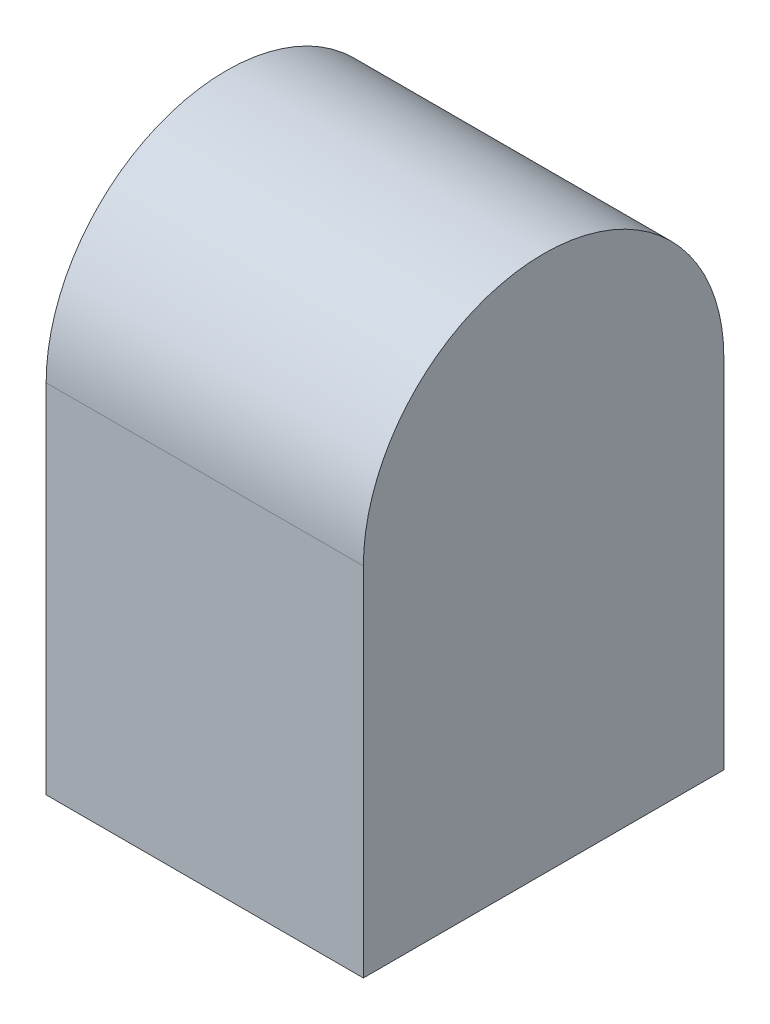
ISO-10303-21;
HEADER;
FILE_DESCRIPTION(('STEP AP214'),'2;1');
FILE_NAME('part.step','',(''),(''),'','','');
FILE_SCHEMA(('AUTOMOTIVE_DESIGN { 1 0 10303 214 1 1 1 1 }'));
ENDSEC;
DATA;
#1=APPLICATION_CONTEXT('core data for automotive mechanical design processes');
#2=APPLICATION_PROTOCOL_DEFINITION('international standard','automotive_design',2000,#1);
#3=PRODUCT_CONTEXT('',#1,'mechanical');
#4=PRODUCT('Part','Part','',(#3));
#5=PRODUCT_RELATED_PRODUCT_CATEGORY('part','',(#4));
#6=PRODUCT_DEFINITION_FORMATION('','',#4);
#7=PRODUCT_DEFINITION_CONTEXT('part definition',#1,'design');
#8=PRODUCT_DEFINITION('design','',#6,#7);
#9=PRODUCT_DEFINITION_SHAPE('','',#8);
#10=(LENGTH_UNIT() NAMED_UNIT(*) SI_UNIT(.MILLI.,.METRE.));
#11=(NAMED_UNIT(*) PLANE_ANGLE_UNIT() SI_UNIT($,.RADIAN.));
#12=(NAMED_UNIT(*) SI_UNIT($,.STERADIAN.) SOLID_ANGLE_UNIT());
#13=UNCERTAINTY_MEASURE_WITH_UNIT(LENGTH_MEASURE(1.E-05),#10,'distance_accuracy_value','');
#14=(GEOMETRIC_REPRESENTATION_CONTEXT(3) GLOBAL_UNCERTAINTY_ASSIGNED_CONTEXT((#13)) GLOBAL_UNIT_ASSIGNED_CONTEXT((#10,
#11,#12)) REPRESENTATION_CONTEXT('',''));
#15=CARTESIAN_POINT('',(0.,0.,0.));
#16=DIRECTION('',(0.,0.,1.));
#17=DIRECTION('',(1.,0.,0.));
#18=AXIS2_PLACEMENT_3D('',#15,#16,#17);
#19=CARTESIAN_POINT('',(0.,0.0495,0.));
#20=DIRECTION('',(1.,0.,0.));
#21=DIRECTION('',(0.,0.,-1.));
#22=AXIS2_PLACEMENT_3D('',#19,#20,#21);
#23=PLANE('',#22);
#24=DIRECTION('',(0.,-1.,0.));
#25=VECTOR('',#24,1.);
#26=CARTESIAN_POINT('',(0.,0.0495,0.));
#27=LINE('',#26,#25);
#28=CARTESIAN_POINT('',(0.,0.0495,0.));
#29=VERTEX_POINT('',#28);
#30=CARTESIAN_POINT('',(0.,0.,0.));
#31=VERTEX_POINT('',#30);
#32=EDGE_CURVE('E11',#29,#31,#27,.T.);
#33=ORIENTED_EDGE('',*,*,#32,.F.);
#34=CARTESIAN_POINT('',(0.,0.0495,-0.025));
#35=DIRECTION('',(-1.,0.,0.));
#36=DIRECTION('',(0.,0.,1.));
#37=AXIS2_PLACEMENT_3D('',#34,#35,#36);
#38=CIRCLE('',#37,0.025);
#39=CARTESIAN_POINT('',(0.,0.0495,-0.05));
#40=VERTEX_POINT('',#39);
#41=EDGE_CURVE('E83',#29,#40,#38,.T.);
#42=ORIENTED_EDGE('',*,*,#41,.T.);
#43=DIRECTION('',(0.,-1.,0.));
#44=VECTOR('',#43,1.);
#45=CARTESIAN_POINT('',(0.,0.0495,-0.05));
#46=LINE('',#45,#44);
#47=CARTESIAN_POINT('',(0.,0.,-0.05));
#48=VERTEX_POINT('',#47);
#49=EDGE_CURVE('E51',#40,#48,#46,.T.);
#50=ORIENTED_EDGE('',*,*,#49,.T.);
#51=DIRECTION('',(0.,0.,1.));
#52=VECTOR('',#51,1.);
#53=CARTESIAN_POINT('',(0.,0.,0.));
#54=LINE('',#53,#52);
#55=EDGE_CURVE('E85',#48,#31,#54,.T.);
#56=ORIENTED_EDGE('',*,*,#55,.T.);
#57=EDGE_LOOP('',(#33,#42,#50,#56));
#58=FACE_BOUND('',#57,.T.);
#59=ADVANCED_FACE('F35',(#58),#23,.F.);
#60=CARTESIAN_POINT('',(0.,0.0495,0.));
#61=DIRECTION('',(0.,0.,-1.));
#62=DIRECTION('',(-1.,0.,0.));
#63=AXIS2_PLACEMENT_3D('',#60,#61,#62);
#64=PLANE('',#63);
#65=DIRECTION('',(1.,0.,0.));
#66=VECTOR('',#65,1.);
#67=CARTESIAN_POINT('',(0.,0.,0.));
#68=LINE('',#67,#66);
#69=CARTESIAN_POINT('',(0.044,0.,0.));
#70=VERTEX_POINT('',#69);
#71=EDGE_CURVE('E100',#31,#70,#68,.T.);
#72=ORIENTED_EDGE('',*,*,#71,.T.);
#73=DIRECTION('',(0.,-1.,0.));
#74=VECTOR('',#73,1.);
#75=CARTESIAN_POINT('',(0.044,0.0495,0.));
#76=LINE('',#75,#74);
#77=CARTESIAN_POINT('',(0.044,0.0495,0.));
#78=VERTEX_POINT('',#77);
#79=EDGE_CURVE('E43',#78,#70,#76,.T.);
#80=ORIENTED_EDGE('',*,*,#79,.F.);
#81=DIRECTION('',(1.,0.,0.));
#82=VECTOR('',#81,1.);
#83=CARTESIAN_POINT('',(0.,0.0495,0.));
#84=LINE('',#83,#82);
#85=EDGE_CURVE('E86',#29,#78,#84,.T.);
#86=ORIENTED_EDGE('',*,*,#85,.F.);
#87=ORIENTED_EDGE('',*,*,#32,.T.);
#88=EDGE_LOOP('',(#72,#80,#86,#87));
#89=FACE_BOUND('',#88,.T.);
#90=ADVANCED_FACE('F87',(#89),#64,.F.);
#91=CARTESIAN_POINT('',(0.044,0.0495,0.));
#92=DIRECTION('',(-1.,0.,0.));
#93=DIRECTION('',(0.,0.,1.));
#94=AXIS2_PLACEMENT_3D('',#91,#92,#93);
#95=PLANE('',#94);
#96=DIRECTION('',(0.,-1.,0.));
#97=VECTOR('',#96,1.);
#98=CARTESIAN_POINT('',(0.044,0.0495,-0.05));
#99=LINE('',#98,#97);
#100=CARTESIAN_POINT('',(0.044,0.0495,-0.05));
#101=VERTEX_POINT('',#100);
#102=CARTESIAN_POINT('',(0.044,0.,-0.05));
#103=VERTEX_POINT('',#102);
#104=EDGE_CURVE('E105',#101,#103,#99,.T.);
#105=ORIENTED_EDGE('',*,*,#104,.F.);
#106=CARTESIAN_POINT('',(0.044,0.0495,-0.025));
#107=DIRECTION('',(-1.,0.,0.));
#108=DIRECTION('',(0.,0.,1.));
#109=AXIS2_PLACEMENT_3D('',#106,#107,#108);
#110=CIRCLE('',#109,0.025);
#111=EDGE_CURVE('E94',#78,#101,#110,.T.);
#112=ORIENTED_EDGE('',*,*,#111,.F.);
#113=ORIENTED_EDGE('',*,*,#79,.T.);
#114=DIRECTION('',(0.,0.,-1.));
#115=VECTOR('',#114,1.);
#116=CARTESIAN_POINT('',(0.044,0.,0.));
#117=LINE('',#116,#115);
#118=EDGE_CURVE('E69',#70,#103,#117,.T.);
#119=ORIENTED_EDGE('',*,*,#118,.T.);
#120=EDGE_LOOP('',(#105,#112,#113,#119));
#121=FACE_BOUND('',#120,.T.);
#122=ADVANCED_FACE('F106',(#121),#95,.F.);
#123=CARTESIAN_POINT('',(0.,0.0495,-0.05));
#124=DIRECTION('',(0.,0.,1.));
#125=DIRECTION('',(1.,0.,0.));
#126=AXIS2_PLACEMENT_3D('',#123,#124,#125);
#127=PLANE('',#126);
#128=DIRECTION('',(-1.,0.,0.));
#129=VECTOR('',#128,1.);
#130=CARTESIAN_POINT('',(0.,0.,-0.05));
#131=LINE('',#130,#129);
#132=EDGE_CURVE('E72',#103,#48,#131,.T.);
#133=ORIENTED_EDGE('',*,*,#132,.T.);
#134=ORIENTED_EDGE('',*,*,#49,.F.);
#135=DIRECTION('',(-1.,0.,0.));
#136=VECTOR('',#135,1.);
#137=CARTESIAN_POINT('',(0.,0.0495,-0.05));
#138=LINE('',#137,#136);
#139=EDGE_CURVE('E91',#101,#40,#138,.T.);
#140=ORIENTED_EDGE('',*,*,#139,.F.);
#141=ORIENTED_EDGE('',*,*,#104,.T.);
#142=EDGE_LOOP('',(#133,#134,#140,#141));
#143=FACE_BOUND('',#142,.T.);
#144=ADVANCED_FACE('F110',(#143),#127,.F.);
#145=CARTESIAN_POINT('',(0.,0.,0.));
#146=DIRECTION('',(0.,-1.,0.));
#147=DIRECTION('',(0.,0.,-1.));
#148=AXIS2_PLACEMENT_3D('',#145,#146,#147);
#149=PLANE('',#148);
#150=ORIENTED_EDGE('',*,*,#55,.F.);
#151=ORIENTED_EDGE('',*,*,#132,.F.);
#152=ORIENTED_EDGE('',*,*,#118,.F.);
#153=ORIENTED_EDGE('',*,*,#71,.F.);
#154=EDGE_LOOP('',(#150,#151,#152,#153));
#155=FACE_BOUND('',#154,.T.);
#156=ADVANCED_FACE('F108',(#155),#149,.T.);
#157=CARTESIAN_POINT('',(0.044,0.0495,-0.025));
#158=DIRECTION('',(-1.,0.,0.));
#159=DIRECTION('',(0.,0.,1.));
#160=AXIS2_PLACEMENT_3D('',#157,#158,#159);
#161=CYLINDRICAL_SURFACE('',#160,0.025);
#162=ORIENTED_EDGE('',*,*,#85,.T.);
#163=ORIENTED_EDGE('',*,*,#111,.T.);
#164=ORIENTED_EDGE('',*,*,#139,.T.);
#165=ORIENTED_EDGE('',*,*,#41,.F.);
#166=EDGE_LOOP('',(#162,#163,#164,#165));
#167=FACE_BOUND('',#166,.T.);
#168=ADVANCED_FACE('F93',(#167),#161,.T.);
#169=CLOSED_SHELL('',(#59,#90,#122,#144,#156,#168));
#170=MANIFOLD_SOLID_BREP('B2',#169);
#171=ADVANCED_BREP_SHAPE_REPRESENTATION('',(#18,#170),#14);
#172=SHAPE_DEFINITION_REPRESENTATION(#9,#171);
ENDSEC;
END-ISO-10303-21;
